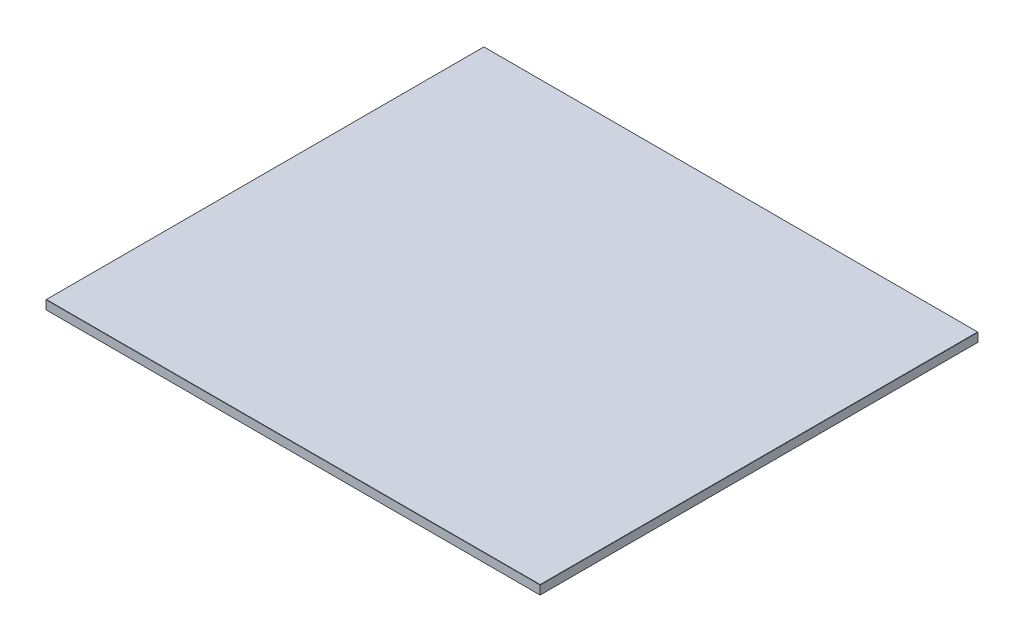
ISO-10303-21;
HEADER;
FILE_DESCRIPTION(('STEP AP214'),'2;1');
FILE_NAME('part.step','',(''),(''),'','','');
FILE_SCHEMA(('AUTOMOTIVE_DESIGN { 1 0 10303 214 1 1 1 1 }'));
ENDSEC;
DATA;
#1=APPLICATION_CONTEXT('core data for automotive mechanical design processes');
#2=APPLICATION_PROTOCOL_DEFINITION('international standard','automotive_design',2000,#1);
#3=PRODUCT_CONTEXT('',#1,'mechanical');
#4=PRODUCT('Part','Part','',(#3));
#5=PRODUCT_RELATED_PRODUCT_CATEGORY('part','',(#4));
#6=PRODUCT_DEFINITION_FORMATION('','',#4);
#7=PRODUCT_DEFINITION_CONTEXT('part definition',#1,'design');
#8=PRODUCT_DEFINITION('design','',#6,#7);
#9=PRODUCT_DEFINITION_SHAPE('','',#8);
#10=(LENGTH_UNIT() NAMED_UNIT(*) SI_UNIT(.MILLI.,.METRE.));
#11=(NAMED_UNIT(*) PLANE_ANGLE_UNIT() SI_UNIT($,.RADIAN.));
#12=(NAMED_UNIT(*) SI_UNIT($,.STERADIAN.) SOLID_ANGLE_UNIT());
#13=UNCERTAINTY_MEASURE_WITH_UNIT(LENGTH_MEASURE(1.E-05),#10,'distance_accuracy_value','');
#14=(GEOMETRIC_REPRESENTATION_CONTEXT(3) GLOBAL_UNCERTAINTY_ASSIGNED_CONTEXT((#13)) GLOBAL_UNIT_ASSIGNED_CONTEXT((#10,
#11,#12)) REPRESENTATION_CONTEXT('',''));
#15=CARTESIAN_POINT('',(0.,0.,0.));
#16=DIRECTION('',(0.,0.,1.));
#17=DIRECTION('',(1.,0.,0.));
#18=AXIS2_PLACEMENT_3D('',#15,#16,#17);
#19=CARTESIAN_POINT('',(325.,12.,288.));
#20=DIRECTION('',(-1.,0.,0.));
#21=DIRECTION('',(0.,0.,1.));
#22=AXIS2_PLACEMENT_3D('',#19,#20,#21);
#23=PLANE('',#22);
#24=DIRECTION('',(0.,-1.,0.));
#25=VECTOR('',#24,1.);
#26=CARTESIAN_POINT('',(325.,12.,288.));
#27=LINE('',#26,#25);
#28=CARTESIAN_POINT('',(325.,11.7500000000003,288.));
#29=VERTEX_POINT('',#28);
#30=CARTESIAN_POINT('',(325.,0.250000000000083,288.));
#31=VERTEX_POINT('',#30);
#32=EDGE_CURVE('E142',#29,#31,#27,.T.);
#33=ORIENTED_EDGE('',*,*,#32,.T.);
#34=DIRECTION('',(0.,0.,-1.));
#35=VECTOR('',#34,1.);
#36=CARTESIAN_POINT('',(325.,0.250000000000083,-288.));
#37=LINE('',#36,#35);
#38=CARTESIAN_POINT('',(325.,0.250000000000083,-288.));
#39=VERTEX_POINT('',#38);
#40=EDGE_CURVE('E151',#31,#39,#37,.T.);
#41=ORIENTED_EDGE('',*,*,#40,.T.);
#42=DIRECTION('',(0.,-1.,0.));
#43=VECTOR('',#42,1.);
#44=CARTESIAN_POINT('',(325.,12.,-288.));
#45=LINE('',#44,#43);
#46=CARTESIAN_POINT('',(325.,11.7500000000003,-288.));
#47=VERTEX_POINT('',#46);
#48=EDGE_CURVE('E120',#47,#39,#45,.T.);
#49=ORIENTED_EDGE('',*,*,#48,.F.);
#50=DIRECTION('',(0.,0.,1.));
#51=VECTOR('',#50,1.);
#52=CARTESIAN_POINT('',(325.,11.7500000000003,288.));
#53=LINE('',#52,#51);
#54=EDGE_CURVE('E153',#47,#29,#53,.T.);
#55=ORIENTED_EDGE('',*,*,#54,.T.);
#56=EDGE_LOOP('',(#33,#41,#49,#55));
#57=FACE_BOUND('',#56,.T.);
#58=ADVANCED_FACE('F33',(#57),#23,.F.);
#59=CARTESIAN_POINT('',(-325.,12.,-288.));
#60=DIRECTION('',(0.,0.,1.));
#61=DIRECTION('',(1.,0.,0.));
#62=AXIS2_PLACEMENT_3D('',#59,#60,#61);
#63=PLANE('',#62);
#64=ORIENTED_EDGE('',*,*,#48,.T.);
#65=DIRECTION('',(-1.,0.,0.));
#66=VECTOR('',#65,1.);
#67=CARTESIAN_POINT('',(-325.,0.250000000000083,-288.));
#68=LINE('',#67,#66);
#69=CARTESIAN_POINT('',(-325.,0.250000000000083,-288.));
#70=VERTEX_POINT('',#69);
#71=EDGE_CURVE('E119',#39,#70,#68,.T.);
#72=ORIENTED_EDGE('',*,*,#71,.T.);
#73=DIRECTION('',(0.,-1.,0.));
#74=VECTOR('',#73,1.);
#75=CARTESIAN_POINT('',(-325.,12.,-288.));
#76=LINE('',#75,#74);
#77=CARTESIAN_POINT('',(-325.,11.7500000000003,-288.));
#78=VERTEX_POINT('',#77);
#79=EDGE_CURVE('E102',#78,#70,#76,.T.);
#80=ORIENTED_EDGE('',*,*,#79,.F.);
#81=DIRECTION('',(1.,0.,0.));
#82=VECTOR('',#81,1.);
#83=CARTESIAN_POINT('',(-325.,11.7500000000003,-288.));
#84=LINE('',#83,#82);
#85=EDGE_CURVE('E116',#78,#47,#84,.T.);
#86=ORIENTED_EDGE('',*,*,#85,.T.);
#87=EDGE_LOOP('',(#64,#72,#80,#86));
#88=FACE_BOUND('',#87,.T.);
#89=ADVANCED_FACE('F115',(#88),#63,.F.);
#90=CARTESIAN_POINT('',(-325.,12.,288.));
#91=DIRECTION('',(1.,0.,0.));
#92=DIRECTION('',(0.,0.,-1.));
#93=AXIS2_PLACEMENT_3D('',#90,#91,#92);
#94=PLANE('',#93);
#95=ORIENTED_EDGE('',*,*,#79,.T.);
#96=DIRECTION('',(0.,0.,1.));
#97=VECTOR('',#96,1.);
#98=CARTESIAN_POINT('',(-325.,0.250000000000083,288.));
#99=LINE('',#98,#97);
#100=CARTESIAN_POINT('',(-325.,0.250000000000083,288.));
#101=VERTEX_POINT('',#100);
#102=EDGE_CURVE('E108',#70,#101,#99,.T.);
#103=ORIENTED_EDGE('',*,*,#102,.T.);
#104=DIRECTION('',(0.,-1.,0.));
#105=VECTOR('',#104,1.);
#106=CARTESIAN_POINT('',(-325.,12.,288.));
#107=LINE('',#106,#105);
#108=CARTESIAN_POINT('',(-325.,11.7500000000003,288.));
#109=VERTEX_POINT('',#108);
#110=EDGE_CURVE('E104',#109,#101,#107,.T.);
#111=ORIENTED_EDGE('',*,*,#110,.F.);
#112=DIRECTION('',(0.,0.,-1.));
#113=VECTOR('',#112,1.);
#114=CARTESIAN_POINT('',(-325.,11.7500000000003,288.));
#115=LINE('',#114,#113);
#116=EDGE_CURVE('E99',#109,#78,#115,.T.);
#117=ORIENTED_EDGE('',*,*,#116,.T.);
#118=EDGE_LOOP('',(#95,#103,#111,#117));
#119=FACE_BOUND('',#118,.T.);
#120=ADVANCED_FACE('F101',(#119),#94,.F.);
#121=CARTESIAN_POINT('',(-325.,12.,288.));
#122=DIRECTION('',(0.,0.,-1.));
#123=DIRECTION('',(-1.,0.,0.));
#124=AXIS2_PLACEMENT_3D('',#121,#122,#123);
#125=PLANE('',#124);
#126=ORIENTED_EDGE('',*,*,#110,.T.);
#127=DIRECTION('',(1.,0.,0.));
#128=VECTOR('',#127,1.);
#129=CARTESIAN_POINT('',(325.,0.250000000000083,288.));
#130=LINE('',#129,#128);
#131=EDGE_CURVE('E155',#101,#31,#130,.T.);
#132=ORIENTED_EDGE('',*,*,#131,.T.);
#133=ORIENTED_EDGE('',*,*,#32,.F.);
#134=DIRECTION('',(-1.,0.,0.));
#135=VECTOR('',#134,1.);
#136=CARTESIAN_POINT('',(-325.,11.7500000000003,288.));
#137=LINE('',#136,#135);
#138=EDGE_CURVE('E157',#29,#109,#137,.T.);
#139=ORIENTED_EDGE('',*,*,#138,.T.);
#140=EDGE_LOOP('',(#126,#132,#133,#139));
#141=FACE_BOUND('',#140,.T.);
#142=ADVANCED_FACE('F195',(#141),#125,.F.);
#143=CARTESIAN_POINT('',(0.,12.,0.));
#144=DIRECTION('',(0.,-1.,0.));
#145=DIRECTION('',(0.,0.,-1.));
#146=AXIS2_PLACEMENT_3D('',#143,#144,#145);
#147=PLANE('',#146);
#148=DIRECTION('',(0.,0.,1.));
#149=VECTOR('',#148,1.);
#150=CARTESIAN_POINT('',(-324.75,12.,0.));
#151=LINE('',#150,#149);
#152=CARTESIAN_POINT('',(-324.75,12.,-287.75));
#153=VERTEX_POINT('',#152);
#154=CARTESIAN_POINT('',(-324.75,12.,287.75));
#155=VERTEX_POINT('',#154);
#156=EDGE_CURVE('E42',#153,#155,#151,.T.);
#157=ORIENTED_EDGE('',*,*,#156,.T.);
#158=DIRECTION('',(1.,0.,0.));
#159=VECTOR('',#158,1.);
#160=CARTESIAN_POINT('',(0.,12.,287.75));
#161=LINE('',#160,#159);
#162=CARTESIAN_POINT('',(324.75,12.,287.75));
#163=VERTEX_POINT('',#162);
#164=EDGE_CURVE('E11',#155,#163,#161,.T.);
#165=ORIENTED_EDGE('',*,*,#164,.T.);
#166=DIRECTION('',(0.,0.,-1.));
#167=VECTOR('',#166,1.);
#168=CARTESIAN_POINT('',(324.75,12.,0.));
#169=LINE('',#168,#167);
#170=CARTESIAN_POINT('',(324.75,12.,-287.75));
#171=VERTEX_POINT('',#170);
#172=EDGE_CURVE('E149',#163,#171,#169,.T.);
#173=ORIENTED_EDGE('',*,*,#172,.T.);
#174=DIRECTION('',(-1.,0.,0.));
#175=VECTOR('',#174,1.);
#176=CARTESIAN_POINT('',(0.,12.,-287.75));
#177=LINE('',#176,#175);
#178=EDGE_CURVE('E53',#171,#153,#177,.T.);
#179=ORIENTED_EDGE('',*,*,#178,.T.);
#180=EDGE_LOOP('',(#157,#165,#173,#179));
#181=FACE_BOUND('',#180,.T.);
#182=ADVANCED_FACE('F201',(#181),#147,.F.);
#183=CARTESIAN_POINT('',(0.,0.,0.));
#184=DIRECTION('',(0.,-1.,0.));
#185=DIRECTION('',(0.,0.,-1.));
#186=AXIS2_PLACEMENT_3D('',#183,#184,#185);
#187=PLANE('',#186);
#188=DIRECTION('',(0.,0.,-1.));
#189=VECTOR('',#188,1.);
#190=CARTESIAN_POINT('',(-324.75,0.,-288.));
#191=LINE('',#190,#189);
#192=CARTESIAN_POINT('',(-324.75,0.,287.75));
#193=VERTEX_POINT('',#192);
#194=CARTESIAN_POINT('',(-324.75,0.,-287.75));
#195=VERTEX_POINT('',#194);
#196=EDGE_CURVE('E162',#193,#195,#191,.T.);
#197=ORIENTED_EDGE('',*,*,#196,.T.);
#198=DIRECTION('',(1.,0.,0.));
#199=VECTOR('',#198,1.);
#200=CARTESIAN_POINT('',(325.,0.,-287.75));
#201=LINE('',#200,#199);
#202=CARTESIAN_POINT('',(324.75,0.,-287.75));
#203=VERTEX_POINT('',#202);
#204=EDGE_CURVE('E109',#195,#203,#201,.T.);
#205=ORIENTED_EDGE('',*,*,#204,.T.);
#206=DIRECTION('',(0.,0.,1.));
#207=VECTOR('',#206,1.);
#208=CARTESIAN_POINT('',(324.75,0.,288.));
#209=LINE('',#208,#207);
#210=CARTESIAN_POINT('',(324.75,0.,287.75));
#211=VERTEX_POINT('',#210);
#212=EDGE_CURVE('E166',#203,#211,#209,.T.);
#213=ORIENTED_EDGE('',*,*,#212,.T.);
#214=DIRECTION('',(-1.,0.,0.));
#215=VECTOR('',#214,1.);
#216=CARTESIAN_POINT('',(-325.,0.,287.75));
#217=LINE('',#216,#215);
#218=EDGE_CURVE('E164',#211,#193,#217,.T.);
#219=ORIENTED_EDGE('',*,*,#218,.T.);
#220=EDGE_LOOP('',(#197,#205,#213,#219));
#221=FACE_BOUND('',#220,.T.);
#222=ADVANCED_FACE('F203',(#221),#187,.T.);
#223=CARTESIAN_POINT('',(-325.,0.250000000000083,288.));
#224=DIRECTION('',(0.,-0.707106781186548,0.707106781186548));
#225=DIRECTION('',(-1.,0.,0.));
#226=AXIS2_PLACEMENT_3D('',#223,#224,#225);
#227=PLANE('',#226);
#228=DIRECTION('',(0.577350269189626,-0.577350269189626,-0.577350269189626));
#229=VECTOR('',#228,1.);
#230=CARTESIAN_POINT('',(-325.,0.250000000000083,288.));
#231=LINE('',#230,#229);
#232=EDGE_CURVE('E143',#193,#101,#231,.F.);
#233=ORIENTED_EDGE('',*,*,#232,.F.);
#234=ORIENTED_EDGE('',*,*,#218,.F.);
#235=DIRECTION('',(-0.577350269189626,-0.577350269189626,-0.577350269189626));
#236=VECTOR('',#235,1.);
#237=CARTESIAN_POINT('',(325.,0.250000000000083,288.));
#238=LINE('',#237,#236);
#239=EDGE_CURVE('E139',#31,#211,#238,.T.);
#240=ORIENTED_EDGE('',*,*,#239,.F.);
#241=ORIENTED_EDGE('',*,*,#131,.F.);
#242=EDGE_LOOP('',(#233,#234,#240,#241));
#243=FACE_BOUND('',#242,.T.);
#244=ADVANCED_FACE('F182',(#243),#227,.T.);
#245=CARTESIAN_POINT('',(325.,0.250000000000083,288.));
#246=DIRECTION('',(0.707106781186548,-0.707106781186548,0.));
#247=DIRECTION('',(0.,0.,1.));
#248=AXIS2_PLACEMENT_3D('',#245,#246,#247);
#249=PLANE('',#248);
#250=ORIENTED_EDGE('',*,*,#239,.T.);
#251=ORIENTED_EDGE('',*,*,#212,.F.);
#252=DIRECTION('',(0.577350269189626,0.577350269189626,-0.577350269189626));
#253=VECTOR('',#252,1.);
#254=CARTESIAN_POINT('',(133.,-191.75,-95.9999999999999));
#255=LINE('',#254,#253);
#256=EDGE_CURVE('E130',#39,#203,#255,.F.);
#257=ORIENTED_EDGE('',*,*,#256,.F.);
#258=ORIENTED_EDGE('',*,*,#40,.F.);
#259=EDGE_LOOP('',(#250,#251,#257,#258));
#260=FACE_BOUND('',#259,.T.);
#261=ADVANCED_FACE('F186',(#260),#249,.T.);
#262=CARTESIAN_POINT('',(-325.,0.250000000000083,288.));
#263=DIRECTION('',(-0.707106781186548,-0.707106781186548,0.));
#264=DIRECTION('',(0.,0.,-1.));
#265=AXIS2_PLACEMENT_3D('',#262,#263,#264);
#266=PLANE('',#265);
#267=ORIENTED_EDGE('',*,*,#232,.T.);
#268=ORIENTED_EDGE('',*,*,#102,.F.);
#269=DIRECTION('',(0.577350269189626,-0.577350269189626,0.577350269189626));
#270=VECTOR('',#269,1.);
#271=CARTESIAN_POINT('',(-133.,-191.75,-95.9999999999999));
#272=LINE('',#271,#270);
#273=EDGE_CURVE('E129',#195,#70,#272,.F.);
#274=ORIENTED_EDGE('',*,*,#273,.F.);
#275=ORIENTED_EDGE('',*,*,#196,.F.);
#276=EDGE_LOOP('',(#267,#268,#274,#275));
#277=FACE_BOUND('',#276,.T.);
#278=ADVANCED_FACE('F194',(#277),#266,.T.);
#279=CARTESIAN_POINT('',(-325.,0.250000000000083,-288.));
#280=DIRECTION('',(0.,-0.707106781186548,-0.707106781186548));
#281=DIRECTION('',(1.,0.,0.));
#282=AXIS2_PLACEMENT_3D('',#279,#280,#281);
#283=PLANE('',#282);
#284=ORIENTED_EDGE('',*,*,#256,.T.);
#285=ORIENTED_EDGE('',*,*,#204,.F.);
#286=ORIENTED_EDGE('',*,*,#273,.T.);
#287=ORIENTED_EDGE('',*,*,#71,.F.);
#288=EDGE_LOOP('',(#284,#285,#286,#287));
#289=FACE_BOUND('',#288,.T.);
#290=ADVANCED_FACE('F189',(#289),#283,.T.);
#291=CARTESIAN_POINT('',(0.,12.,-287.75));
#292=DIRECTION('',(0.,-0.707106781186548,0.707106781186548));
#293=DIRECTION('',(-1.,0.,0.));
#294=AXIS2_PLACEMENT_3D('',#291,#292,#293);
#295=PLANE('',#294);
#296=DIRECTION('',(-0.577350269189626,0.577350269189626,0.577350269189626));
#297=VECTOR('',#296,1.);
#298=CARTESIAN_POINT('',(228.833333333334,107.916666666667,-191.833333333333));
#299=LINE('',#298,#297);
#300=EDGE_CURVE('E125',#47,#171,#299,.T.);
#301=ORIENTED_EDGE('',*,*,#300,.F.);
#302=ORIENTED_EDGE('',*,*,#85,.F.);
#303=DIRECTION('',(0.577350269189626,0.577350269189626,0.577350269189626));
#304=VECTOR('',#303,1.);
#305=CARTESIAN_POINT('',(-216.5,120.25,-179.5));
#306=LINE('',#305,#304);
#307=EDGE_CURVE('E37',#153,#78,#306,.F.);
#308=ORIENTED_EDGE('',*,*,#307,.F.);
#309=ORIENTED_EDGE('',*,*,#178,.F.);
#310=EDGE_LOOP('',(#301,#302,#308,#309));
#311=FACE_BOUND('',#310,.T.);
#312=ADVANCED_FACE('F35',(#311),#295,.F.);
#313=CARTESIAN_POINT('',(-324.75,12.,0.));
#314=DIRECTION('',(0.707106781186548,-0.707106781186548,0.));
#315=DIRECTION('',(0.,0.,1.));
#316=AXIS2_PLACEMENT_3D('',#313,#314,#315);
#317=PLANE('',#316);
#318=ORIENTED_EDGE('',*,*,#307,.T.);
#319=ORIENTED_EDGE('',*,*,#116,.F.);
#320=DIRECTION('',(0.577350269189626,0.577350269189626,-0.577350269189626));
#321=VECTOR('',#320,1.);
#322=CARTESIAN_POINT('',(-228.833333333334,107.916666666667,191.833333333333));
#323=LINE('',#322,#321);
#324=EDGE_CURVE('E132',#155,#109,#323,.F.);
#325=ORIENTED_EDGE('',*,*,#324,.F.);
#326=ORIENTED_EDGE('',*,*,#156,.F.);
#327=EDGE_LOOP('',(#318,#319,#325,#326));
#328=FACE_BOUND('',#327,.T.);
#329=ADVANCED_FACE('F128',(#328),#317,.F.);
#330=CARTESIAN_POINT('',(324.75,12.,0.));
#331=DIRECTION('',(-0.707106781186548,-0.707106781186548,0.));
#332=DIRECTION('',(0.,0.,-1.));
#333=AXIS2_PLACEMENT_3D('',#330,#331,#332);
#334=PLANE('',#333);
#335=ORIENTED_EDGE('',*,*,#300,.T.);
#336=ORIENTED_EDGE('',*,*,#172,.F.);
#337=DIRECTION('',(0.577350269189626,-0.577350269189626,0.577350269189626));
#338=VECTOR('',#337,1.);
#339=CARTESIAN_POINT('',(228.833333333334,107.916666666667,191.833333333333));
#340=LINE('',#339,#338);
#341=EDGE_CURVE('E135',#29,#163,#340,.F.);
#342=ORIENTED_EDGE('',*,*,#341,.F.);
#343=ORIENTED_EDGE('',*,*,#54,.F.);
#344=EDGE_LOOP('',(#335,#336,#342,#343));
#345=FACE_BOUND('',#344,.T.);
#346=ADVANCED_FACE('F200',(#345),#334,.F.);
#347=CARTESIAN_POINT('',(0.,12.,287.75));
#348=DIRECTION('',(0.,-0.707106781186548,-0.707106781186548));
#349=DIRECTION('',(1.,0.,0.));
#350=AXIS2_PLACEMENT_3D('',#347,#348,#349);
#351=PLANE('',#350);
#352=ORIENTED_EDGE('',*,*,#324,.T.);
#353=ORIENTED_EDGE('',*,*,#138,.F.);
#354=ORIENTED_EDGE('',*,*,#341,.T.);
#355=ORIENTED_EDGE('',*,*,#164,.F.);
#356=EDGE_LOOP('',(#352,#353,#354,#355));
#357=FACE_BOUND('',#356,.T.);
#358=ADVANCED_FACE('F198',(#357),#351,.F.);
#359=CLOSED_SHELL('',(#58,#89,#120,#142,#182,#222,#244,#261,#278,#290,#312,#329,#346,#358));
#360=MANIFOLD_SOLID_BREP('B2',#359);
#361=ADVANCED_BREP_SHAPE_REPRESENTATION('',(#18,#360),#14);
#362=SHAPE_DEFINITION_REPRESENTATION(#9,#361);
ENDSEC;
END-ISO-10303-21;
